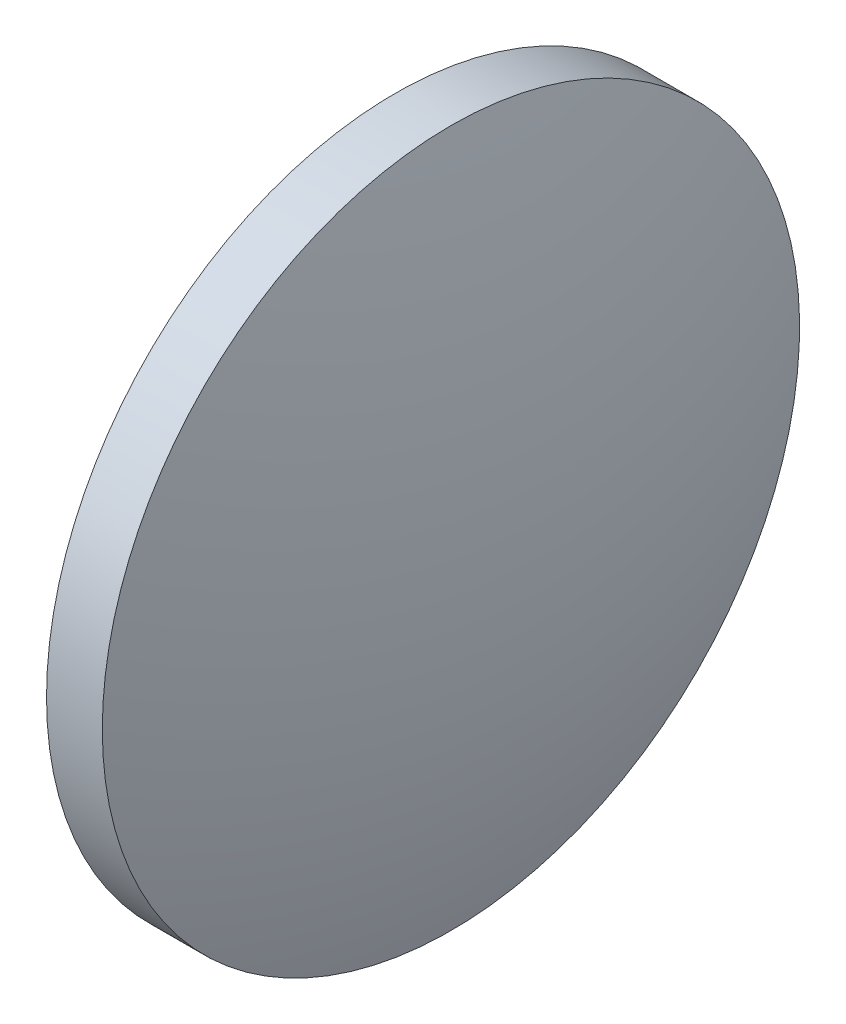
ISO-10303-21;
HEADER;
FILE_DESCRIPTION(('STEP AP214'),'2;1');
FILE_NAME('part.step','',(''),(''),'','','');
FILE_SCHEMA(('AUTOMOTIVE_DESIGN { 1 0 10303 214 1 1 1 1 }'));
ENDSEC;
DATA;
#1=APPLICATION_CONTEXT('core data for automotive mechanical design processes');
#2=APPLICATION_PROTOCOL_DEFINITION('international standard','automotive_design',2000,#1);
#3=PRODUCT_CONTEXT('',#1,'mechanical');
#4=PRODUCT('Part','Part','',(#3));
#5=PRODUCT_RELATED_PRODUCT_CATEGORY('part','',(#4));
#6=PRODUCT_DEFINITION_FORMATION('','',#4);
#7=PRODUCT_DEFINITION_CONTEXT('part definition',#1,'design');
#8=PRODUCT_DEFINITION('design','',#6,#7);
#9=PRODUCT_DEFINITION_SHAPE('','',#8);
#10=(LENGTH_UNIT() NAMED_UNIT(*) SI_UNIT(.MILLI.,.METRE.));
#11=(NAMED_UNIT(*) PLANE_ANGLE_UNIT() SI_UNIT($,.RADIAN.));
#12=(NAMED_UNIT(*) SI_UNIT($,.STERADIAN.) SOLID_ANGLE_UNIT());
#13=UNCERTAINTY_MEASURE_WITH_UNIT(LENGTH_MEASURE(1.E-05),#10,'distance_accuracy_value','');
#14=(GEOMETRIC_REPRESENTATION_CONTEXT(3) GLOBAL_UNCERTAINTY_ASSIGNED_CONTEXT((#13)) GLOBAL_UNIT_ASSIGNED_CONTEXT((#10,
#11,#12)) REPRESENTATION_CONTEXT('',''));
#15=CARTESIAN_POINT('',(0.,0.,0.));
#16=DIRECTION('',(0.,0.,1.));
#17=DIRECTION('',(1.,0.,0.));
#18=AXIS2_PLACEMENT_3D('',#15,#16,#17);
#19=CARTESIAN_POINT('',(654.611953300577,125.554307898423,0.));
#20=DIRECTION('',(-1.,0.,0.));
#21=DIRECTION('',(0.,1.,0.));
#22=AXIS2_PLACEMENT_3D('',#19,#20,#21);
#23=SPHERICAL_SURFACE('',#22,41.240618556701);
#24=CARTESIAN_POINT('',(693.912571857278,125.554307898423,0.));
#25=DIRECTION('',(-1.,0.,0.));
#26=DIRECTION('',(0.,0.,1.));
#27=AXIS2_PLACEMENT_3D('',#24,#25,#26);
#28=CIRCLE('',#27,12.5);
#29=CARTESIAN_POINT('',(693.912571857278,125.554307898423,12.5));
#30=VERTEX_POINT('',#29);
#31=EDGE_CURVE('E10',#30,#30,#28,.T.);
#32=ORIENTED_EDGE('',*,*,#31,.F.);
#33=EDGE_LOOP('',(#32));
#34=FACE_BOUND('',#33,.T.);
#35=ADVANCED_FACE('F35',(#34),#23,.T.);
#36=CARTESIAN_POINT('',(689.883464278841,125.554307898423,0.));
#37=DIRECTION('',(-1.,0.,0.));
#38=DIRECTION('',(0.,0.,1.));
#39=AXIS2_PLACEMENT_3D('',#36,#37,#38);
#40=CYLINDRICAL_SURFACE('',#39,12.5);
#41=CARTESIAN_POINT('',(691.912571857278,125.554307898423,0.));
#42=DIRECTION('',(-1.,0.,0.));
#43=DIRECTION('',(0.,0.,1.));
#44=AXIS2_PLACEMENT_3D('',#41,#42,#43);
#45=CIRCLE('',#44,12.5);
#46=CARTESIAN_POINT('',(691.912571857278,125.554307898423,12.5));
#47=VERTEX_POINT('',#46);
#48=EDGE_CURVE('E41',#47,#47,#45,.T.);
#49=ORIENTED_EDGE('',*,*,#48,.F.);
#50=EDGE_LOOP('',(#49));
#51=FACE_BOUND('',#50,.T.);
#52=ORIENTED_EDGE('',*,*,#31,.T.);
#53=EDGE_LOOP('',(#52));
#54=FACE_BOUND('',#53,.T.);
#55=ADVANCED_FACE('F49',(#51,#54),#40,.T.);
#56=CARTESIAN_POINT('',(691.912571857278,125.554307898423,0.));
#57=DIRECTION('',(1.,0.,0.));
#58=DIRECTION('',(0.,0.,-1.));
#59=AXIS2_PLACEMENT_3D('',#56,#57,#58);
#60=PLANE('',#59);
#61=ORIENTED_EDGE('',*,*,#48,.T.);
#62=EDGE_LOOP('',(#61));
#63=FACE_BOUND('',#62,.T.);
#64=ADVANCED_FACE('F47',(#63),#60,.F.);
#65=CLOSED_SHELL('',(#35,#55,#64));
#66=MANIFOLD_SOLID_BREP('B2',#65);
#67=ADVANCED_BREP_SHAPE_REPRESENTATION('',(#18,#66),#14);
#68=SHAPE_DEFINITION_REPRESENTATION(#9,#67);
ENDSEC;
END-ISO-10303-21;
